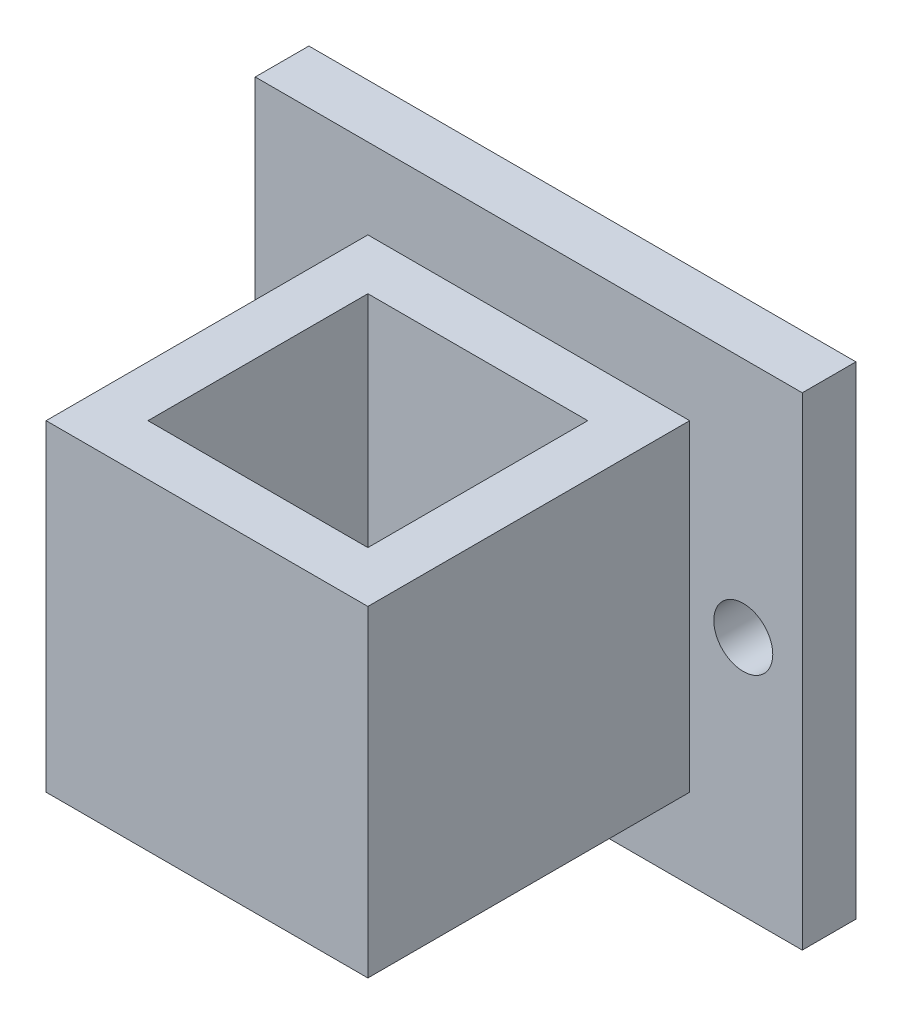
ISO-10303-21;
HEADER;
FILE_DESCRIPTION(('STEP AP214'),'2;1');
FILE_NAME('part.step','',(''),(''),'','','');
FILE_SCHEMA(('AUTOMOTIVE_DESIGN { 1 0 10303 214 1 1 1 1 }'));
ENDSEC;
DATA;
#1=APPLICATION_CONTEXT('core data for automotive mechanical design processes');
#2=APPLICATION_PROTOCOL_DEFINITION('international standard','automotive_design',2000,#1);
#3=PRODUCT_CONTEXT('',#1,'mechanical');
#4=PRODUCT('Part','Part','',(#3));
#5=PRODUCT_RELATED_PRODUCT_CATEGORY('part','',(#4));
#6=PRODUCT_DEFINITION_FORMATION('','',#4);
#7=PRODUCT_DEFINITION_CONTEXT('part definition',#1,'design');
#8=PRODUCT_DEFINITION('design','',#6,#7);
#9=PRODUCT_DEFINITION_SHAPE('','',#8);
#10=(LENGTH_UNIT() NAMED_UNIT(*) SI_UNIT(.MILLI.,.METRE.));
#11=(NAMED_UNIT(*) PLANE_ANGLE_UNIT() SI_UNIT($,.RADIAN.));
#12=(NAMED_UNIT(*) SI_UNIT($,.STERADIAN.) SOLID_ANGLE_UNIT());
#13=UNCERTAINTY_MEASURE_WITH_UNIT(LENGTH_MEASURE(1.E-05),#10,'distance_accuracy_value','');
#14=(GEOMETRIC_REPRESENTATION_CONTEXT(3) GLOBAL_UNCERTAINTY_ASSIGNED_CONTEXT((#13)) GLOBAL_UNIT_ASSIGNED_CONTEXT((#10,
#11,#12)) REPRESENTATION_CONTEXT('',''));
#15=CARTESIAN_POINT('',(0.,0.,0.));
#16=DIRECTION('',(0.,0.,1.));
#17=DIRECTION('',(1.,0.,0.));
#18=AXIS2_PLACEMENT_3D('',#15,#16,#17);
#19=CARTESIAN_POINT('',(25.4999999999986,-59.999999999996,5.));
#20=DIRECTION('',(-1.,0.,0.));
#21=DIRECTION('',(0.,0.,1.));
#22=AXIS2_PLACEMENT_3D('',#19,#20,#21);
#23=PLANE('',#22);
#24=DIRECTION('',(0.,1.,0.));
#25=VECTOR('',#24,1.);
#26=CARTESIAN_POINT('',(25.4999999999986,-59.999999999996,0.));
#27=LINE('',#26,#25);
#28=CARTESIAN_POINT('',(25.4999999999986,-59.999999999996,0.));
#29=VERTEX_POINT('',#28);
#30=CARTESIAN_POINT('',(25.4999999999986,-14.9999999999962,0.));
#31=VERTEX_POINT('',#30);
#32=EDGE_CURVE('E182',#29,#31,#27,.T.);
#33=ORIENTED_EDGE('',*,*,#32,.T.);
#34=DIRECTION('',(0.,0.,-1.));
#35=VECTOR('',#34,1.);
#36=CARTESIAN_POINT('',(25.4999999999986,-14.9999999999962,5.));
#37=LINE('',#36,#35);
#38=CARTESIAN_POINT('',(25.4999999999986,-14.9999999999962,5.));
#39=VERTEX_POINT('',#38);
#40=EDGE_CURVE('E209',#39,#31,#37,.T.);
#41=ORIENTED_EDGE('',*,*,#40,.F.);
#42=DIRECTION('',(0.,1.,0.));
#43=VECTOR('',#42,1.);
#44=CARTESIAN_POINT('',(25.4999999999986,-59.999999999996,5.));
#45=LINE('',#44,#43);
#46=CARTESIAN_POINT('',(25.4999999999986,-59.999999999996,5.));
#47=VERTEX_POINT('',#46);
#48=EDGE_CURVE('E183',#47,#39,#45,.T.);
#49=ORIENTED_EDGE('',*,*,#48,.F.);
#50=DIRECTION('',(0.,0.,-1.));
#51=VECTOR('',#50,1.);
#52=CARTESIAN_POINT('',(25.4999999999986,-59.999999999996,5.));
#53=LINE('',#52,#51);
#54=EDGE_CURVE('E193',#47,#29,#53,.T.);
#55=ORIENTED_EDGE('',*,*,#54,.T.);
#56=EDGE_LOOP('',(#33,#41,#49,#55));
#57=FACE_BOUND('',#56,.T.);
#58=ADVANCED_FACE('F33',(#57),#23,.F.);
#59=CARTESIAN_POINT('',(25.4999999999986,-14.9999999999962,5.));
#60=DIRECTION('',(0.,-1.,0.));
#61=DIRECTION('',(1.,0.,0.));
#62=AXIS2_PLACEMENT_3D('',#59,#60,#61);
#63=PLANE('',#62);
#64=DIRECTION('',(-1.,0.,0.));
#65=VECTOR('',#64,1.);
#66=CARTESIAN_POINT('',(25.4999999999986,-14.9999999999962,0.));
#67=LINE('',#66,#65);
#68=CARTESIAN_POINT('',(-25.5,-14.9999999999962,0.));
#69=VERTEX_POINT('',#68);
#70=EDGE_CURVE('E196',#31,#69,#67,.T.);
#71=ORIENTED_EDGE('',*,*,#70,.T.);
#72=DIRECTION('',(0.,0.,-1.));
#73=VECTOR('',#72,1.);
#74=CARTESIAN_POINT('',(-25.5,-14.9999999999962,5.));
#75=LINE('',#74,#73);
#76=CARTESIAN_POINT('',(-25.5,-14.9999999999962,5.));
#77=VERTEX_POINT('',#76);
#78=EDGE_CURVE('E206',#77,#69,#75,.T.);
#79=ORIENTED_EDGE('',*,*,#78,.F.);
#80=DIRECTION('',(-1.,0.,0.));
#81=VECTOR('',#80,1.);
#82=CARTESIAN_POINT('',(25.4999999999986,-14.9999999999962,5.));
#83=LINE('',#82,#81);
#84=EDGE_CURVE('E186',#39,#77,#83,.T.);
#85=ORIENTED_EDGE('',*,*,#84,.F.);
#86=ORIENTED_EDGE('',*,*,#40,.T.);
#87=EDGE_LOOP('',(#71,#79,#85,#86));
#88=FACE_BOUND('',#87,.T.);
#89=ADVANCED_FACE('F234',(#88),#63,.F.);
#90=CARTESIAN_POINT('',(-25.5,-59.999999999996,5.));
#91=DIRECTION('',(1.,0.,0.));
#92=DIRECTION('',(0.,0.,-1.));
#93=AXIS2_PLACEMENT_3D('',#90,#91,#92);
#94=PLANE('',#93);
#95=DIRECTION('',(0.,-1.,0.));
#96=VECTOR('',#95,1.);
#97=CARTESIAN_POINT('',(-25.5,-59.999999999996,0.));
#98=LINE('',#97,#96);
#99=CARTESIAN_POINT('',(-25.5,-59.999999999996,0.));
#100=VERTEX_POINT('',#99);
#101=EDGE_CURVE('E198',#69,#100,#98,.T.);
#102=ORIENTED_EDGE('',*,*,#101,.T.);
#103=DIRECTION('',(0.,0.,-1.));
#104=VECTOR('',#103,1.);
#105=CARTESIAN_POINT('',(-25.5,-59.999999999996,5.));
#106=LINE('',#105,#104);
#107=CARTESIAN_POINT('',(-25.5,-59.999999999996,5.));
#108=VERTEX_POINT('',#107);
#109=EDGE_CURVE('E203',#108,#100,#106,.T.);
#110=ORIENTED_EDGE('',*,*,#109,.F.);
#111=DIRECTION('',(0.,-1.,0.));
#112=VECTOR('',#111,1.);
#113=CARTESIAN_POINT('',(-25.5,-59.999999999996,5.));
#114=LINE('',#113,#112);
#115=EDGE_CURVE('E189',#77,#108,#114,.T.);
#116=ORIENTED_EDGE('',*,*,#115,.F.);
#117=ORIENTED_EDGE('',*,*,#78,.T.);
#118=EDGE_LOOP('',(#102,#110,#116,#117));
#119=FACE_BOUND('',#118,.T.);
#120=ADVANCED_FACE('F239',(#119),#94,.F.);
#121=CARTESIAN_POINT('',(25.4999999999986,-59.999999999996,5.));
#122=DIRECTION('',(0.,1.,0.));
#123=DIRECTION('',(-1.,0.,0.));
#124=AXIS2_PLACEMENT_3D('',#121,#122,#123);
#125=PLANE('',#124);
#126=DIRECTION('',(1.,0.,0.));
#127=VECTOR('',#126,1.);
#128=CARTESIAN_POINT('',(25.4999999999986,-59.999999999996,0.));
#129=LINE('',#128,#127);
#130=EDGE_CURVE('E187',#100,#29,#129,.T.);
#131=ORIENTED_EDGE('',*,*,#130,.T.);
#132=ORIENTED_EDGE('',*,*,#54,.F.);
#133=DIRECTION('',(1.,0.,0.));
#134=VECTOR('',#133,1.);
#135=CARTESIAN_POINT('',(25.4999999999986,-59.999999999996,5.));
#136=LINE('',#135,#134);
#137=EDGE_CURVE('E191',#108,#47,#136,.T.);
#138=ORIENTED_EDGE('',*,*,#137,.F.);
#139=ORIENTED_EDGE('',*,*,#109,.T.);
#140=EDGE_LOOP('',(#131,#132,#138,#139));
#141=FACE_BOUND('',#140,.T.);
#142=ADVANCED_FACE('F256',(#141),#125,.F.);
#143=CARTESIAN_POINT('',(0.,0.,5.));
#144=DIRECTION('',(0.,0.,1.));
#145=DIRECTION('',(1.,0.,0.));
#146=AXIS2_PLACEMENT_3D('',#143,#144,#145);
#147=PLANE('',#146);
#148=CARTESIAN_POINT('',(-20.,-37.4999999999969,5.));
#149=DIRECTION('',(0.,0.,1.));
#150=DIRECTION('',(1.,0.,0.));
#151=AXIS2_PLACEMENT_3D('',#148,#149,#150);
#152=CIRCLE('',#151,2.75);
#153=CARTESIAN_POINT('',(-17.25,-37.4999999999969,5.));
#154=VERTEX_POINT('',#153);
#155=EDGE_CURVE('E378',#154,#154,#152,.T.);
#156=ORIENTED_EDGE('',*,*,#155,.F.);
#157=EDGE_LOOP('',(#156));
#158=FACE_BOUND('',#157,.T.);
#159=CARTESIAN_POINT('',(19.999999999998,-37.4999999999961,5.));
#160=DIRECTION('',(0.,0.,1.));
#161=DIRECTION('',(1.,0.,0.));
#162=AXIS2_PLACEMENT_3D('',#159,#160,#161);
#163=CIRCLE('',#162,2.75);
#164=CARTESIAN_POINT('',(22.749999999998,-37.4999999999961,5.));
#165=VERTEX_POINT('',#164);
#166=EDGE_CURVE('E382',#165,#165,#163,.T.);
#167=ORIENTED_EDGE('',*,*,#166,.F.);
#168=EDGE_LOOP('',(#167));
#169=FACE_BOUND('',#168,.T.);
#170=DIRECTION('',(0.,-1.,0.));
#171=VECTOR('',#170,1.);
#172=CARTESIAN_POINT('',(-15.0000000000007,-22.4999999999961,5.));
#173=LINE('',#172,#171);
#174=CARTESIAN_POINT('',(-15.0000000000007,-22.4999999999961,5.));
#175=VERTEX_POINT('',#174);
#176=CARTESIAN_POINT('',(-15.0000000000007,-52.4999999999961,5.));
#177=VERTEX_POINT('',#176);
#178=EDGE_CURVE('E147',#175,#177,#173,.T.);
#179=ORIENTED_EDGE('',*,*,#178,.F.);
#180=DIRECTION('',(-1.,0.,0.));
#181=VECTOR('',#180,1.);
#182=CARTESIAN_POINT('',(-15.0000000000007,-22.4999999999961,5.));
#183=LINE('',#182,#181);
#184=CARTESIAN_POINT('',(14.9999999999993,-22.4999999999961,5.));
#185=VERTEX_POINT('',#184);
#186=EDGE_CURVE('E154',#185,#175,#183,.T.);
#187=ORIENTED_EDGE('',*,*,#186,.F.);
#188=DIRECTION('',(0.,1.,0.));
#189=VECTOR('',#188,1.);
#190=CARTESIAN_POINT('',(14.9999999999993,-22.4999999999961,5.));
#191=LINE('',#190,#189);
#192=CARTESIAN_POINT('',(14.9999999999993,-52.4999999999961,5.));
#193=VERTEX_POINT('',#192);
#194=EDGE_CURVE('E166',#193,#185,#191,.T.);
#195=ORIENTED_EDGE('',*,*,#194,.F.);
#196=DIRECTION('',(1.,0.,0.));
#197=VECTOR('',#196,1.);
#198=CARTESIAN_POINT('',(-15.0000000000007,-52.4999999999961,5.));
#199=LINE('',#198,#197);
#200=EDGE_CURVE('E163',#177,#193,#199,.T.);
#201=ORIENTED_EDGE('',*,*,#200,.F.);
#202=EDGE_LOOP('',(#179,#187,#195,#201));
#203=FACE_BOUND('',#202,.T.);
#204=ORIENTED_EDGE('',*,*,#48,.T.);
#205=ORIENTED_EDGE('',*,*,#84,.T.);
#206=ORIENTED_EDGE('',*,*,#115,.T.);
#207=ORIENTED_EDGE('',*,*,#137,.T.);
#208=EDGE_LOOP('',(#204,#205,#206,#207));
#209=FACE_BOUND('',#208,.T.);
#210=ADVANCED_FACE('F252',(#158,#169,#203,#209),#147,.T.);
#211=CARTESIAN_POINT('',(0.,0.,0.));
#212=DIRECTION('',(0.,0.,1.));
#213=DIRECTION('',(1.,0.,0.));
#214=AXIS2_PLACEMENT_3D('',#211,#212,#213);
#215=PLANE('',#214);
#216=CARTESIAN_POINT('',(-20.,-37.4999999999969,0.));
#217=DIRECTION('',(0.,0.,-1.));
#218=DIRECTION('',(-1.,0.,0.));
#219=AXIS2_PLACEMENT_3D('',#216,#217,#218);
#220=CIRCLE('',#219,2.75);
#221=CARTESIAN_POINT('',(-22.75,-37.4999999999969,0.));
#222=VERTEX_POINT('',#221);
#223=EDGE_CURVE('E381',#222,#222,#220,.T.);
#224=ORIENTED_EDGE('',*,*,#223,.F.);
#225=EDGE_LOOP('',(#224));
#226=FACE_BOUND('',#225,.T.);
#227=CARTESIAN_POINT('',(19.999999999998,-37.4999999999961,0.));
#228=DIRECTION('',(0.,0.,-1.));
#229=DIRECTION('',(-1.,0.,0.));
#230=AXIS2_PLACEMENT_3D('',#227,#228,#229);
#231=CIRCLE('',#230,2.75);
#232=CARTESIAN_POINT('',(17.249999999998,-37.4999999999961,0.));
#233=VERTEX_POINT('',#232);
#234=EDGE_CURVE('E383',#233,#233,#231,.T.);
#235=ORIENTED_EDGE('',*,*,#234,.F.);
#236=EDGE_LOOP('',(#235));
#237=FACE_BOUND('',#236,.T.);
#238=ORIENTED_EDGE('',*,*,#32,.F.);
#239=ORIENTED_EDGE('',*,*,#130,.F.);
#240=ORIENTED_EDGE('',*,*,#101,.F.);
#241=ORIENTED_EDGE('',*,*,#70,.F.);
#242=EDGE_LOOP('',(#238,#239,#240,#241));
#243=FACE_BOUND('',#242,.T.);
#244=ADVANCED_FACE('F247',(#226,#237,#243),#215,.F.);
#245=CARTESIAN_POINT('',(-15.0000000000007,-22.4999999999961,35.));
#246=DIRECTION('',(1.,0.,0.));
#247=DIRECTION('',(0.,0.,-1.));
#248=AXIS2_PLACEMENT_3D('',#245,#246,#247);
#249=PLANE('',#248);
#250=ORIENTED_EDGE('',*,*,#178,.T.);
#251=DIRECTION('',(0.,0.,-1.));
#252=VECTOR('',#251,1.);
#253=CARTESIAN_POINT('',(-15.0000000000007,-52.4999999999961,35.));
#254=LINE('',#253,#252);
#255=CARTESIAN_POINT('',(-15.0000000000007,-52.4999999999961,35.));
#256=VERTEX_POINT('',#255);
#257=EDGE_CURVE('E179',#256,#177,#254,.T.);
#258=ORIENTED_EDGE('',*,*,#257,.F.);
#259=DIRECTION('',(0.,-1.,0.));
#260=VECTOR('',#259,1.);
#261=CARTESIAN_POINT('',(-15.0000000000007,-22.4999999999961,35.));
#262=LINE('',#261,#260);
#263=CARTESIAN_POINT('',(-15.0000000000007,-22.4999999999961,35.));
#264=VERTEX_POINT('',#263);
#265=EDGE_CURVE('E150',#264,#256,#262,.T.);
#266=ORIENTED_EDGE('',*,*,#265,.F.);
#267=DIRECTION('',(0.,0.,-1.));
#268=VECTOR('',#267,1.);
#269=CARTESIAN_POINT('',(-15.0000000000007,-22.4999999999961,35.));
#270=LINE('',#269,#268);
#271=EDGE_CURVE('E160',#264,#175,#270,.T.);
#272=ORIENTED_EDGE('',*,*,#271,.T.);
#273=EDGE_LOOP('',(#250,#258,#266,#272));
#274=FACE_BOUND('',#273,.T.);
#275=ADVANCED_FACE('F267',(#274),#249,.F.);
#276=CARTESIAN_POINT('',(-15.0000000000007,-52.4999999999961,35.));
#277=DIRECTION('',(0.,1.,0.));
#278=DIRECTION('',(0.,0.,1.));
#279=AXIS2_PLACEMENT_3D('',#276,#277,#278);
#280=PLANE('',#279);
#281=DIRECTION('',(1.,0.,0.));
#282=VECTOR('',#281,1.);
#283=CARTESIAN_POINT('',(-10.2500000000007,-52.4999999999961,9.74999999999999));
#284=LINE('',#283,#282);
#285=CARTESIAN_POINT('',(-10.2500000000007,-52.4999999999961,9.74999999999999));
#286=VERTEX_POINT('',#285);
#287=CARTESIAN_POINT('',(10.2499999999993,-52.4999999999961,9.74999999999999));
#288=VERTEX_POINT('',#287);
#289=EDGE_CURVE('E133',#286,#288,#284,.T.);
#290=ORIENTED_EDGE('',*,*,#289,.F.);
#291=DIRECTION('',(0.,0.,-1.));
#292=VECTOR('',#291,1.);
#293=CARTESIAN_POINT('',(-10.2500000000007,-52.4999999999961,30.25));
#294=LINE('',#293,#292);
#295=CARTESIAN_POINT('',(-10.2500000000007,-52.4999999999961,30.25));
#296=VERTEX_POINT('',#295);
#297=EDGE_CURVE('E47',#296,#286,#294,.T.);
#298=ORIENTED_EDGE('',*,*,#297,.F.);
#299=DIRECTION('',(-1.,0.,0.));
#300=VECTOR('',#299,1.);
#301=CARTESIAN_POINT('',(-10.2500000000007,-52.4999999999961,30.25));
#302=LINE('',#301,#300);
#303=CARTESIAN_POINT('',(10.2499999999993,-52.4999999999961,30.25));
#304=VERTEX_POINT('',#303);
#305=EDGE_CURVE('E140',#304,#296,#302,.T.);
#306=ORIENTED_EDGE('',*,*,#305,.F.);
#307=DIRECTION('',(0.,0.,1.));
#308=VECTOR('',#307,1.);
#309=CARTESIAN_POINT('',(10.2499999999993,-52.4999999999961,30.25));
#310=LINE('',#309,#308);
#311=EDGE_CURVE('E124',#288,#304,#310,.T.);
#312=ORIENTED_EDGE('',*,*,#311,.F.);
#313=EDGE_LOOP('',(#290,#298,#306,#312));
#314=FACE_BOUND('',#313,.T.);
#315=ORIENTED_EDGE('',*,*,#200,.T.);
#316=DIRECTION('',(0.,0.,-1.));
#317=VECTOR('',#316,1.);
#318=CARTESIAN_POINT('',(14.9999999999993,-52.4999999999961,35.));
#319=LINE('',#318,#317);
#320=CARTESIAN_POINT('',(14.9999999999993,-52.4999999999961,35.));
#321=VERTEX_POINT('',#320);
#322=EDGE_CURVE('E176',#321,#193,#319,.T.);
#323=ORIENTED_EDGE('',*,*,#322,.F.);
#324=DIRECTION('',(1.,0.,0.));
#325=VECTOR('',#324,1.);
#326=CARTESIAN_POINT('',(-15.0000000000007,-52.4999999999961,35.));
#327=LINE('',#326,#325);
#328=EDGE_CURVE('E153',#256,#321,#327,.T.);
#329=ORIENTED_EDGE('',*,*,#328,.F.);
#330=ORIENTED_EDGE('',*,*,#257,.T.);
#331=EDGE_LOOP('',(#315,#323,#329,#330));
#332=FACE_BOUND('',#331,.T.);
#333=ADVANCED_FACE('F137',(#314,#332),#280,.F.);
#334=CARTESIAN_POINT('',(14.9999999999993,-22.4999999999961,35.));
#335=DIRECTION('',(-1.,0.,0.));
#336=DIRECTION('',(0.,0.,1.));
#337=AXIS2_PLACEMENT_3D('',#334,#335,#336);
#338=PLANE('',#337);
#339=ORIENTED_EDGE('',*,*,#194,.T.);
#340=DIRECTION('',(0.,0.,-1.));
#341=VECTOR('',#340,1.);
#342=CARTESIAN_POINT('',(14.9999999999993,-22.4999999999961,35.));
#343=LINE('',#342,#341);
#344=CARTESIAN_POINT('',(14.9999999999993,-22.4999999999961,35.));
#345=VERTEX_POINT('',#344);
#346=EDGE_CURVE('E173',#345,#185,#343,.T.);
#347=ORIENTED_EDGE('',*,*,#346,.F.);
#348=DIRECTION('',(0.,1.,0.));
#349=VECTOR('',#348,1.);
#350=CARTESIAN_POINT('',(14.9999999999993,-22.4999999999961,35.));
#351=LINE('',#350,#349);
#352=EDGE_CURVE('E156',#321,#345,#351,.T.);
#353=ORIENTED_EDGE('',*,*,#352,.F.);
#354=ORIENTED_EDGE('',*,*,#322,.T.);
#355=EDGE_LOOP('',(#339,#347,#353,#354));
#356=FACE_BOUND('',#355,.T.);
#357=ADVANCED_FACE('F277',(#356),#338,.F.);
#358=CARTESIAN_POINT('',(-15.0000000000007,-22.4999999999961,35.));
#359=DIRECTION('',(0.,-1.,0.));
#360=DIRECTION('',(0.,0.,-1.));
#361=AXIS2_PLACEMENT_3D('',#358,#359,#360);
#362=PLANE('',#361);
#363=DIRECTION('',(-1.,0.,0.));
#364=VECTOR('',#363,1.);
#365=CARTESIAN_POINT('',(-15.0000000000007,-22.4999999999961,30.25));
#366=LINE('',#365,#364);
#367=CARTESIAN_POINT('',(10.2499999999993,-22.4999999999961,30.25));
#368=VERTEX_POINT('',#367);
#369=CARTESIAN_POINT('',(-10.2500000000007,-22.4999999999961,30.25));
#370=VERTEX_POINT('',#369);
#371=EDGE_CURVE('E40',#368,#370,#366,.T.);
#372=ORIENTED_EDGE('',*,*,#371,.T.);
#373=DIRECTION('',(0.,0.,-1.));
#374=VECTOR('',#373,1.);
#375=CARTESIAN_POINT('',(-10.2500000000007,-22.4999999999961,35.));
#376=LINE('',#375,#374);
#377=CARTESIAN_POINT('',(-10.2500000000007,-22.4999999999961,9.74999999999999));
#378=VERTEX_POINT('',#377);
#379=EDGE_CURVE('E11',#370,#378,#376,.T.);
#380=ORIENTED_EDGE('',*,*,#379,.T.);
#381=DIRECTION('',(1.,0.,0.));
#382=VECTOR('',#381,1.);
#383=CARTESIAN_POINT('',(-15.0000000000007,-22.4999999999961,9.74999999999999));
#384=LINE('',#383,#382);
#385=CARTESIAN_POINT('',(10.2499999999993,-22.4999999999961,9.74999999999999));
#386=VERTEX_POINT('',#385);
#387=EDGE_CURVE('E212',#378,#386,#384,.T.);
#388=ORIENTED_EDGE('',*,*,#387,.T.);
#389=DIRECTION('',(0.,0.,1.));
#390=VECTOR('',#389,1.);
#391=CARTESIAN_POINT('',(10.2499999999993,-22.4999999999961,35.));
#392=LINE('',#391,#390);
#393=EDGE_CURVE('E127',#386,#368,#392,.T.);
#394=ORIENTED_EDGE('',*,*,#393,.T.);
#395=EDGE_LOOP('',(#372,#380,#388,#394));
#396=FACE_BOUND('',#395,.T.);
#397=ORIENTED_EDGE('',*,*,#186,.T.);
#398=ORIENTED_EDGE('',*,*,#271,.F.);
#399=DIRECTION('',(-1.,0.,0.));
#400=VECTOR('',#399,1.);
#401=CARTESIAN_POINT('',(-15.0000000000007,-22.4999999999961,35.));
#402=LINE('',#401,#400);
#403=EDGE_CURVE('E158',#345,#264,#402,.T.);
#404=ORIENTED_EDGE('',*,*,#403,.F.);
#405=ORIENTED_EDGE('',*,*,#346,.T.);
#406=EDGE_LOOP('',(#397,#398,#404,#405));
#407=FACE_BOUND('',#406,.T.);
#408=ADVANCED_FACE('F216',(#396,#407),#362,.F.);
#409=CARTESIAN_POINT('',(0.,0.,35.));
#410=DIRECTION('',(0.,0.,1.));
#411=DIRECTION('',(1.,0.,0.));
#412=AXIS2_PLACEMENT_3D('',#409,#410,#411);
#413=PLANE('',#412);
#414=ORIENTED_EDGE('',*,*,#265,.T.);
#415=ORIENTED_EDGE('',*,*,#328,.T.);
#416=ORIENTED_EDGE('',*,*,#352,.T.);
#417=ORIENTED_EDGE('',*,*,#403,.T.);
#418=EDGE_LOOP('',(#414,#415,#416,#417));
#419=FACE_BOUND('',#418,.T.);
#420=ADVANCED_FACE('F223',(#419),#413,.T.);
#421=CARTESIAN_POINT('',(-10.2500000000007,-14.9999999999962,30.25));
#422=DIRECTION('',(-1.,0.,0.));
#423=DIRECTION('',(0.,0.,1.));
#424=AXIS2_PLACEMENT_3D('',#421,#422,#423);
#425=PLANE('',#424);
#426=DIRECTION('',(0.,-1.,0.));
#427=VECTOR('',#426,1.);
#428=CARTESIAN_POINT('',(-10.2500000000007,-14.9999999999962,30.25));
#429=LINE('',#428,#427);
#430=EDGE_CURVE('E145',#370,#296,#429,.T.);
#431=ORIENTED_EDGE('',*,*,#430,.T.);
#432=ORIENTED_EDGE('',*,*,#297,.T.);
#433=DIRECTION('',(0.,-1.,0.));
#434=VECTOR('',#433,1.);
#435=CARTESIAN_POINT('',(-10.2500000000007,-14.9999999999962,9.74999999999999));
#436=LINE('',#435,#434);
#437=EDGE_CURVE('E130',#378,#286,#436,.T.);
#438=ORIENTED_EDGE('',*,*,#437,.F.);
#439=ORIENTED_EDGE('',*,*,#379,.F.);
#440=EDGE_LOOP('',(#431,#432,#438,#439));
#441=FACE_BOUND('',#440,.T.);
#442=ADVANCED_FACE('F221',(#441),#425,.F.);
#443=CARTESIAN_POINT('',(-10.2500000000007,-14.9999999999962,30.25));
#444=DIRECTION('',(0.,0.,1.));
#445=DIRECTION('',(1.,0.,0.));
#446=AXIS2_PLACEMENT_3D('',#443,#444,#445);
#447=PLANE('',#446);
#448=DIRECTION('',(0.,-1.,0.));
#449=VECTOR('',#448,1.);
#450=CARTESIAN_POINT('',(10.2499999999993,-14.9999999999962,30.25));
#451=LINE('',#450,#449);
#452=EDGE_CURVE('E129',#368,#304,#451,.T.);
#453=ORIENTED_EDGE('',*,*,#452,.T.);
#454=ORIENTED_EDGE('',*,*,#305,.T.);
#455=ORIENTED_EDGE('',*,*,#430,.F.);
#456=ORIENTED_EDGE('',*,*,#371,.F.);
#457=EDGE_LOOP('',(#453,#454,#455,#456));
#458=FACE_BOUND('',#457,.T.);
#459=ADVANCED_FACE('F220',(#458),#447,.F.);
#460=CARTESIAN_POINT('',(10.2499999999993,-14.9999999999962,30.25));
#461=DIRECTION('',(1.,0.,0.));
#462=DIRECTION('',(0.,0.,-1.));
#463=AXIS2_PLACEMENT_3D('',#460,#461,#462);
#464=PLANE('',#463);
#465=DIRECTION('',(0.,-1.,0.));
#466=VECTOR('',#465,1.);
#467=CARTESIAN_POINT('',(10.2499999999993,-14.9999999999962,9.74999999999999));
#468=LINE('',#467,#466);
#469=EDGE_CURVE('E55',#386,#288,#468,.T.);
#470=ORIENTED_EDGE('',*,*,#469,.T.);
#471=ORIENTED_EDGE('',*,*,#311,.T.);
#472=ORIENTED_EDGE('',*,*,#452,.F.);
#473=ORIENTED_EDGE('',*,*,#393,.F.);
#474=EDGE_LOOP('',(#470,#471,#472,#473));
#475=FACE_BOUND('',#474,.T.);
#476=ADVANCED_FACE('F121',(#475),#464,.F.);
#477=CARTESIAN_POINT('',(-10.2500000000007,-14.9999999999962,9.74999999999999));
#478=DIRECTION('',(0.,0.,-1.));
#479=DIRECTION('',(-1.,0.,0.));
#480=AXIS2_PLACEMENT_3D('',#477,#478,#479);
#481=PLANE('',#480);
#482=ORIENTED_EDGE('',*,*,#437,.T.);
#483=ORIENTED_EDGE('',*,*,#289,.T.);
#484=ORIENTED_EDGE('',*,*,#469,.F.);
#485=ORIENTED_EDGE('',*,*,#387,.F.);
#486=EDGE_LOOP('',(#482,#483,#484,#485));
#487=FACE_BOUND('',#486,.T.);
#488=ADVANCED_FACE('F134',(#487),#481,.F.);
#489=CARTESIAN_POINT('',(19.999999999998,-37.4999999999961,35.));
#490=DIRECTION('',(0.,0.,-1.));
#491=DIRECTION('',(-1.,0.,0.));
#492=AXIS2_PLACEMENT_3D('',#489,#490,#491);
#493=CYLINDRICAL_SURFACE('',#492,2.75);
#494=ORIENTED_EDGE('',*,*,#166,.T.);
#495=EDGE_LOOP('',(#494));
#496=FACE_BOUND('',#495,.T.);
#497=ORIENTED_EDGE('',*,*,#234,.T.);
#498=EDGE_LOOP('',(#497));
#499=FACE_BOUND('',#498,.T.);
#500=ADVANCED_FACE('F345',(#496,#499),#493,.F.);
#501=CARTESIAN_POINT('',(-20.,-37.4999999999969,35.));
#502=DIRECTION('',(0.,0.,-1.));
#503=DIRECTION('',(-1.,0.,0.));
#504=AXIS2_PLACEMENT_3D('',#501,#502,#503);
#505=CYLINDRICAL_SURFACE('',#504,2.75);
#506=ORIENTED_EDGE('',*,*,#155,.T.);
#507=EDGE_LOOP('',(#506));
#508=FACE_BOUND('',#507,.T.);
#509=ORIENTED_EDGE('',*,*,#223,.T.);
#510=EDGE_LOOP('',(#509));
#511=FACE_BOUND('',#510,.T.);
#512=ADVANCED_FACE('F369',(#508,#511),#505,.F.);
#513=CLOSED_SHELL('',(#58,#89,#120,#142,#210,#244,#275,#333,#357,#408,#420,#442,#459,#476,#488,
#500,#512));
#514=MANIFOLD_SOLID_BREP('B2',#513);
#515=ADVANCED_BREP_SHAPE_REPRESENTATION('',(#18,#514),#14);
#516=SHAPE_DEFINITION_REPRESENTATION(#9,#515);
ENDSEC;
END-ISO-10303-21;
